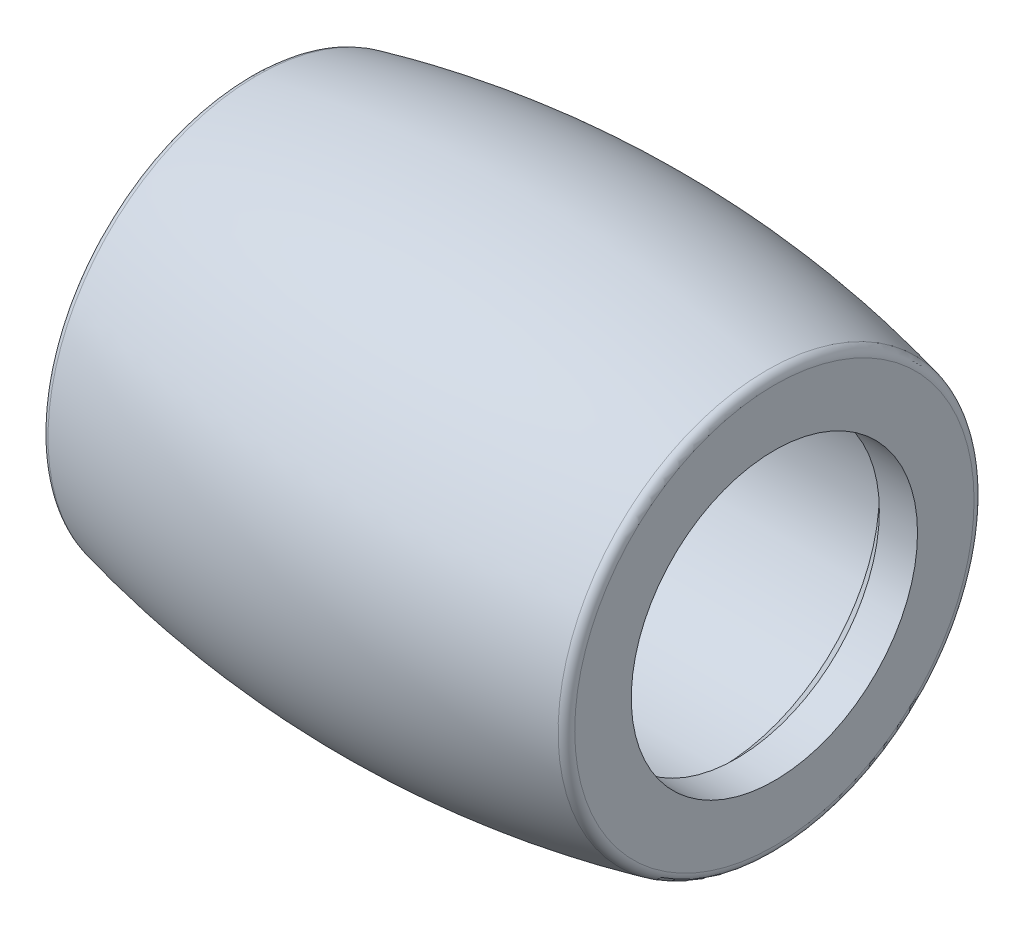
ISO-10303-21;
HEADER;
FILE_DESCRIPTION(('STEP AP214'),'2;1');
FILE_NAME('part.step','',(''),(''),'','','');
FILE_SCHEMA(('AUTOMOTIVE_DESIGN { 1 0 10303 214 1 1 1 1 }'));
ENDSEC;
DATA;
#1=APPLICATION_CONTEXT('core data for automotive mechanical design processes');
#2=APPLICATION_PROTOCOL_DEFINITION('international standard','automotive_design',2000,#1);
#3=PRODUCT_CONTEXT('',#1,'mechanical');
#4=PRODUCT('Part','Part','',(#3));
#5=PRODUCT_RELATED_PRODUCT_CATEGORY('part','',(#4));
#6=PRODUCT_DEFINITION_FORMATION('','',#4);
#7=PRODUCT_DEFINITION_CONTEXT('part definition',#1,'design');
#8=PRODUCT_DEFINITION('design','',#6,#7);
#9=PRODUCT_DEFINITION_SHAPE('','',#8);
#10=(LENGTH_UNIT() NAMED_UNIT(*) SI_UNIT(.MILLI.,.METRE.));
#11=(NAMED_UNIT(*) PLANE_ANGLE_UNIT() SI_UNIT($,.RADIAN.));
#12=(NAMED_UNIT(*) SI_UNIT($,.STERADIAN.) SOLID_ANGLE_UNIT());
#13=UNCERTAINTY_MEASURE_WITH_UNIT(LENGTH_MEASURE(1.E-05),#10,'distance_accuracy_value','');
#14=(GEOMETRIC_REPRESENTATION_CONTEXT(3) GLOBAL_UNCERTAINTY_ASSIGNED_CONTEXT((#13)) GLOBAL_UNIT_ASSIGNED_CONTEXT((#10,
#11,#12)) REPRESENTATION_CONTEXT('',''));
#15=CARTESIAN_POINT('',(0.,0.,0.));
#16=DIRECTION('',(0.,0.,1.));
#17=DIRECTION('',(1.,0.,0.));
#18=AXIS2_PLACEMENT_3D('',#15,#16,#17);
#19=CARTESIAN_POINT('',(-9.075,27.5,0.));
#20=DIRECTION('',(1.,0.,0.));
#21=DIRECTION('',(0.,0.,-1.));
#22=AXIS2_PLACEMENT_3D('',#19,#20,#21);
#23=CYLINDRICAL_SURFACE('',#22,5.);
#24=CARTESIAN_POINT('',(-6.55000000006112,27.5,0.));
#25=DIRECTION('',(1.,0.,0.));
#26=DIRECTION('',(0.,0.,-1.));
#27=AXIS2_PLACEMENT_3D('',#24,#25,#26);
#28=CIRCLE('',#27,4.99999999993861);
#29=CARTESIAN_POINT('',(-6.55000000006112,27.5,-4.99999999993861));
#30=VERTEX_POINT('',#29);
#31=EDGE_CURVE('E168',#30,#30,#28,.F.);
#32=ORIENTED_EDGE('',*,*,#31,.T.);
#33=EDGE_LOOP('',(#32));
#34=FACE_BOUND('',#33,.T.);
#35=CARTESIAN_POINT('',(6.55000000006112,27.5,0.));
#36=DIRECTION('',(-1.,0.,0.));
#37=DIRECTION('',(0.,0.,1.));
#38=AXIS2_PLACEMENT_3D('',#35,#36,#37);
#39=CIRCLE('',#38,4.99999999999545);
#40=CARTESIAN_POINT('',(6.55000000006112,27.5,4.99999999999545));
#41=VERTEX_POINT('',#40);
#42=EDGE_CURVE('E165',#41,#41,#39,.F.);
#43=ORIENTED_EDGE('',*,*,#42,.T.);
#44=EDGE_LOOP('',(#43));
#45=FACE_BOUND('',#44,.T.);
#46=ADVANCED_FACE('F16',(#34,#45),#23,.F.);
#47=CARTESIAN_POINT('',(-6.5500000001748,27.5,0.));
#48=DIRECTION('',(1.,0.,0.));
#49=DIRECTION('',(0.,0.,-1.));
#50=AXIS2_PLACEMENT_3D('',#47,#48,#49);
#51=CONICAL_SURFACE('',#50,4.99999999982492,0.785398163397448);
#52=ORIENTED_EDGE('',*,*,#31,.F.);
#53=EDGE_LOOP('',(#52));
#54=FACE_BOUND('',#53,.T.);
#55=CARTESIAN_POINT('',(-7.05,27.5,0.));
#56=DIRECTION('',(1.,0.,0.));
#57=DIRECTION('',(0.,0.,-1.));
#58=AXIS2_PLACEMENT_3D('',#55,#56,#57);
#59=CIRCLE('',#58,4.5);
#60=CARTESIAN_POINT('',(-7.05,27.5,-4.5));
#61=VERTEX_POINT('',#60);
#62=EDGE_CURVE('E162',#61,#61,#59,.F.);
#63=ORIENTED_EDGE('',*,*,#62,.T.);
#64=EDGE_LOOP('',(#63));
#65=FACE_BOUND('',#64,.T.);
#66=ADVANCED_FACE('F137',(#54,#65),#51,.F.);
#67=CARTESIAN_POINT('',(6.55000000006112,27.5,0.));
#68=DIRECTION('',(-1.,0.,0.));
#69=DIRECTION('',(0.,-1.,0.));
#70=AXIS2_PLACEMENT_3D('',#67,#68,#69);
#71=CONICAL_SURFACE('',#70,4.99999999999545,0.785398163454292);
#72=CARTESIAN_POINT('',(7.05,27.5,0.));
#73=DIRECTION('',(1.,0.,0.));
#74=DIRECTION('',(0.,0.,-1.));
#75=AXIS2_PLACEMENT_3D('',#72,#73,#74);
#76=CIRCLE('',#75,4.5);
#77=CARTESIAN_POINT('',(7.05,27.5,-4.5));
#78=VERTEX_POINT('',#77);
#79=EDGE_CURVE('E71',#78,#78,#76,.T.);
#80=ORIENTED_EDGE('',*,*,#79,.T.);
#81=EDGE_LOOP('',(#80));
#82=FACE_BOUND('',#81,.T.);
#83=ORIENTED_EDGE('',*,*,#42,.F.);
#84=EDGE_LOOP('',(#83));
#85=FACE_BOUND('',#84,.T.);
#86=ADVANCED_FACE('F133',(#82,#85),#71,.F.);
#87=CARTESIAN_POINT('',(-9.075,27.5,0.));
#88=DIRECTION('',(1.,0.,0.));
#89=DIRECTION('',(0.,0.,-1.));
#90=AXIS2_PLACEMENT_3D('',#87,#88,#89);
#91=CYLINDRICAL_SURFACE('',#90,4.5);
#92=ORIENTED_EDGE('',*,*,#62,.F.);
#93=EDGE_LOOP('',(#92));
#94=FACE_BOUND('',#93,.T.);
#95=CARTESIAN_POINT('',(-8.25,27.5,0.));
#96=DIRECTION('',(1.,0.,0.));
#97=DIRECTION('',(0.,0.,-1.));
#98=AXIS2_PLACEMENT_3D('',#95,#96,#97);
#99=CIRCLE('',#98,4.5);
#100=CARTESIAN_POINT('',(-8.25,27.5,-4.5));
#101=VERTEX_POINT('',#100);
#102=EDGE_CURVE('E64',#101,#101,#99,.F.);
#103=ORIENTED_EDGE('',*,*,#102,.T.);
#104=EDGE_LOOP('',(#103));
#105=FACE_BOUND('',#104,.T.);
#106=ADVANCED_FACE('F129',(#94,#105),#91,.F.);
#107=CARTESIAN_POINT('',(-9.075,27.5,0.));
#108=DIRECTION('',(1.,0.,0.));
#109=DIRECTION('',(0.,0.,-1.));
#110=AXIS2_PLACEMENT_3D('',#107,#108,#109);
#111=CYLINDRICAL_SURFACE('',#110,4.5);
#112=ORIENTED_EDGE('',*,*,#79,.F.);
#113=EDGE_LOOP('',(#112));
#114=FACE_BOUND('',#113,.T.);
#115=CARTESIAN_POINT('',(8.25,27.5,0.));
#116=DIRECTION('',(1.,0.,0.));
#117=DIRECTION('',(0.,0.,-1.));
#118=AXIS2_PLACEMENT_3D('',#115,#116,#117);
#119=CIRCLE('',#118,4.5);
#120=CARTESIAN_POINT('',(8.25,27.5,-4.5));
#121=VERTEX_POINT('',#120);
#122=EDGE_CURVE('E59',#121,#121,#119,.F.);
#123=ORIENTED_EDGE('',*,*,#122,.F.);
#124=EDGE_LOOP('',(#123));
#125=FACE_BOUND('',#124,.T.);
#126=ADVANCED_FACE('F125',(#114,#125),#111,.F.);
#127=CARTESIAN_POINT('',(-8.25,27.5,0.));
#128=DIRECTION('',(1.,0.,0.));
#129=DIRECTION('',(0.,0.,-1.));
#130=AXIS2_PLACEMENT_3D('',#127,#128,#129);
#131=PLANE('',#130);
#132=CARTESIAN_POINT('',(-8.24999999998339,27.5,0.));
#133=DIRECTION('',(1.,0.,0.));
#134=DIRECTION('',(0.,0.,-1.));
#135=AXIS2_PLACEMENT_3D('',#132,#133,#134);
#136=CIRCLE('',#135,6.27702305906739);
#137=CARTESIAN_POINT('',(-8.24999999999585,33.7768331617389,0.0491290998852763));
#138=VERTEX_POINT('',#137);
#139=CARTESIAN_POINT('',(-8.25,21.2231673117957,-0.0491290960355121));
#140=VERTEX_POINT('',#139);
#141=EDGE_CURVE('E72',#138,#140,#136,.T.);
#142=ORIENTED_EDGE('',*,*,#141,.F.);
#143=DIRECTION('',(0.,0.003913436133961,-0.999992342479494));
#144=VECTOR('',#143,1.);
#145=CARTESIAN_POINT('',(-8.25,33.7768339509583,0.049129106205928));
#146=LINE('',#145,#144);
#147=CARTESIAN_POINT('',(-8.25,33.7770262160479,0.));
#148=VERTEX_POINT('',#147);
#149=EDGE_CURVE('E62',#148,#138,#146,.F.);
#150=ORIENTED_EDGE('',*,*,#149,.F.);
#151=CARTESIAN_POINT('',(-8.25,21.2231660490486,-0.0491291059191057));
#152=CARTESIAN_POINT('',(-8.25,21.2519452129893,-3.72601330568912));
#153=CARTESIAN_POINT('',(-8.25,23.8722449062931,-6.30561311497492));
#154=CARTESIAN_POINT('',(-8.25,27.5491291060625,-6.27683395095026));
#155=CARTESIAN_POINT('',(-8.25,31.2260133058318,-6.2480547869256));
#156=CARTESIAN_POINT('',(-8.25,33.8056131150578,-3.62775509356284));
#157=CARTESIAN_POINT('',(-8.25,33.7768339509491,0.0491291062058564));
#158=(BOUNDED_CURVE() B_SPLINE_CURVE(3,(#151,#152,#153,#154,#155,#156,#157),.UNSPECIFIED.,.F.,
.F.) B_SPLINE_CURVE_WITH_KNOTS((4,3,4),(0.,0.5,1.),
.UNSPECIFIED.) CURVE() GEOMETRIC_REPRESENTATION_ITEM() RATIONAL_B_SPLINE_CURVE((1.,
0.804737854118981,0.804737854118981,1.,0.804737854118981,0.804737854118981,1.)) REPRESENTATION_ITEM(''));
#159=EDGE_CURVE('E58',#140,#148,#158,.T.);
#160=ORIENTED_EDGE('',*,*,#159,.F.);
#161=EDGE_LOOP('',(#142,#150,#160));
#162=FACE_BOUND('',#161,.T.);
#163=ORIENTED_EDGE('',*,*,#102,.F.);
#164=EDGE_LOOP('',(#163));
#165=FACE_BOUND('',#164,.T.);
#166=ADVANCED_FACE('F121',(#162,#165),#131,.F.);
#167=CARTESIAN_POINT('',(8.25,27.5,0.));
#168=DIRECTION('',(1.,0.,0.));
#169=DIRECTION('',(0.,0.,-1.));
#170=AXIS2_PLACEMENT_3D('',#167,#168,#169);
#171=PLANE('',#170);
#172=DIRECTION('',(0.,0.0027193663312331,-0.999996302516543));
#173=VECTOR('',#172,1.);
#174=CARTESIAN_POINT('',(8.25,21.2229737839488,0.));
#175=LINE('',#174,#173);
#176=CARTESIAN_POINT('',(8.25,21.2229737839488,-2.26550820204424E-13));
#177=VERTEX_POINT('',#176);
#178=CARTESIAN_POINT('',(8.25,21.2230630421132,-0.0332540212333076));
#179=VERTEX_POINT('',#178);
#180=EDGE_CURVE('E50',#177,#179,#175,.T.);
#181=ORIENTED_EDGE('',*,*,#180,.T.);
#182=CARTESIAN_POINT('',(8.25,27.5,0.));
#183=DIRECTION('',(1.,0.,0.));
#184=DIRECTION('',(0.,0.,-1.));
#185=AXIS2_PLACEMENT_3D('',#182,#183,#184);
#186=CIRCLE('',#185,6.2770262160512);
#187=EDGE_CURVE('E52',#177,#179,#186,.F.);
#188=ORIENTED_EDGE('',*,*,#187,.F.);
#189=EDGE_LOOP('',(#181,#188));
#190=FACE_BOUND('',#189,.T.);
#191=ORIENTED_EDGE('',*,*,#122,.T.);
#192=EDGE_LOOP('',(#191));
#193=FACE_BOUND('',#192,.T.);
#194=ADVANCED_FACE('F56',(#190,#193),#171,.T.);
#195=CARTESIAN_POINT('',(-8.01873198847112,20.9311545940471,-0.0514146947708205));
#196=CARTESIAN_POINT('',(-8.01873198847112,20.9612726249392,-3.89935524451549));
#197=CARTESIAN_POINT('',(-8.01873198847112,23.7034741451769,-6.5989634369316));
#198=CARTESIAN_POINT('',(-8.01873198847112,27.5514146949209,-6.56884540595168));
#199=CARTESIAN_POINT('',(-8.01873198847112,31.3993552446648,-6.53872737497177));
#200=CARTESIAN_POINT('',(-8.01873198847112,34.0989634370183,-3.79652585467239));
#201=CARTESIAN_POINT('',(-8.01873198847112,34.0688454059505,0.0514146950709067));
#202=CARTESIAN_POINT('',(-8.15993776943606,20.9643887682665,-0.0511545691600242));
#203=CARTESIAN_POINT('',(-8.15993776943606,20.9943544211037,-3.8796269903809));
#204=CARTESIAN_POINT('',(-8.15993776943606,23.7226821480891,-6.56557688465687));
#205=CARTESIAN_POINT('',(-8.15993776943606,27.5511545693093,-6.53561123173229));
#206=CARTESIAN_POINT('',(-8.15993776943606,31.3796269905295,-6.50564557880771));
#207=CARTESIAN_POINT('',(-8.15993776943606,34.0655768847432,-3.77731785176091));
#208=CARTESIAN_POINT('',(-8.15993776943606,34.0356112317311,0.0511545694585891));
#209=CARTESIAN_POINT('',(-8.25000000000193,21.0781061942674,-0.0502644969499736));
#210=CARTESIAN_POINT('',(-8.25000000000194,21.1075504548753,-3.8121227922965));
#211=CARTESIAN_POINT('',(-8.25000000000194,23.7884062017508,-6.45133806642537));
#212=CARTESIAN_POINT('',(-8.25000000000193,27.5502644970967,-6.42189380573147));
#213=CARTESIAN_POINT('',(-8.25000000000194,31.3121227924425,-6.39244954503758));
#214=CARTESIAN_POINT('',(-8.25000000000194,33.9513380665102,-3.71159379810184));
#215=CARTESIAN_POINT('',(-8.25000000000193,33.9218938057303,0.0502644972433484));
#216=CARTESIAN_POINT('',(-8.25,21.2231660490395,-0.0491291059191772));
#217=CARTESIAN_POINT('',(-8.25,21.2519452129802,-3.72601330569454));
#218=CARTESIAN_POINT('',(-8.25,23.8722449062878,-6.30561311498409));
#219=CARTESIAN_POINT('',(-8.25,27.5491291060626,-6.27683395095939));
#220=CARTESIAN_POINT('',(-8.25,31.2260133058373,-6.2480547869347));
#221=CARTESIAN_POINT('',(-8.25,33.805613115067,-3.62775509356812));
#222=CARTESIAN_POINT('',(-8.25,33.7768339509583,0.0491291062059279));
#223=CARTESIAN_POINT('',(-8.25,21.2233660429135,-0.0491275405567196));
#224=CARTESIAN_POINT('',(-8.25,21.2521442898861,-3.72589458663308));
#225=CARTESIAN_POINT('',(-8.25,23.8723604946244,-6.30541220414199));
#226=CARTESIAN_POINT('',(-8.25,27.5491275407001,-6.27663395708539));
#227=CARTESIAN_POINT('',(-8.25,31.2258945867758,-6.24785571002879));
#228=CARTESIAN_POINT('',(-8.25,33.8054122042249,-3.62763950523158));
#229=CARTESIAN_POINT('',(-8.25,33.7766339570843,0.0491275408434612));
#230=CARTESIAN_POINT('',(-8.24999999999999,21.2235660367875,-0.049125975194262));
#231=CARTESIAN_POINT('',(-8.24999999999999,21.252343366792,-3.72577586757162));
#232=CARTESIAN_POINT('',(-8.24999999999999,23.8724760829609,-6.30521129329988));
#233=CARTESIAN_POINT('',(-8.24999999999999,27.5491259753376,-6.27643396321138));
#234=CARTESIAN_POINT('',(-8.24999999999999,31.2257758677143,-6.24765663312288));
#235=CARTESIAN_POINT('',(-8.24999999999999,33.8052112933827,-3.62752391689505));
#236=CARTESIAN_POINT('',(-8.24999999999999,33.7764339632103,0.0491259754809945));
#237=CARTESIAN_POINT('',(-8.24999999999999,21.2237660306615,-0.0491244098318045));
#238=CARTESIAN_POINT('',(-8.24999999999999,21.2525424436979,-3.72565714851015));
#239=CARTESIAN_POINT('',(-8.24999999999999,23.8725916712975,-6.30501038245777));
#240=CARTESIAN_POINT('',(-8.24999999999999,27.5491244099752,-6.27623396933737));
#241=CARTESIAN_POINT('',(-8.24999999999999,31.2256571486529,-6.24745755621698));
#242=CARTESIAN_POINT('',(-8.24999999999999,33.8050103825406,-3.62740832855851));
#243=CARTESIAN_POINT('',(-8.24999999999999,33.7762339693362,0.0491244101185278));
#244=(BOUNDED_SURFACE() B_SPLINE_SURFACE(3,3,((#195,#196,#197,#198,#199,#200,#201),(#202,#203,
#204,#205,#206,#207,#208),(#209,#210,#211,#212,#213,#214,#215),(#216,#217,#218,#219,#220,#221,
#222),(#223,#224,#225,#226,#227,#228,#229),(#230,#231,#232,#233,#234,#235,#236),(#237,#238,#239,
#240,#241,#242,#243)),.UNSPECIFIED.,.F.,.F.,.F.) B_SPLINE_SURFACE_WITH_KNOTS((4,3,4),(4,3,4),
(0.,1.,1.00161071180641),(0.,0.5,1.),
.UNSPECIFIED.) GEOMETRIC_REPRESENTATION_ITEM() RATIONAL_B_SPLINE_SURFACE(((1.,0.804737854118981,
0.804737854118981,1.,0.804737854118981,0.804737854118981,1.),(0.855956339210433,
0.688820467635743,0.688820467635743,0.855956339210433,0.688820467635743,0.688820467635743,
0.855956339210433),(0.855956339210433,0.688820467635743,0.688820467635743,0.855956339210433,
0.688820467635743,0.688820467635743,0.855956339210433),(1.,0.804737854118981,0.804737854118981,
1.,0.804737854118981,0.804737854118981,1.),(1.,0.804737854118981,0.804737854118981,1.,
0.804737854118981,0.804737854118981,1.),(1.,0.804737854118981,0.804737854118981,1.,
0.804737854118981,0.804737854118981,1.),(1.,0.804737854118981,0.804737854118981,1.,
0.804737854118981,0.804737854118981,1.))) REPRESENTATION_ITEM('') SURFACE());
#245=CARTESIAN_POINT('',(-7.95000000000001,33.7768339509645,0.0491291059191954));
#246=DIRECTION('',(0.,-0.00782681228788601,0.999969370035608));
#247=DIRECTION('',(0.,-0.999969370035608,-0.00782681228788602));
#248=AXIS2_PLACEMENT_3D('',#245,#246,#247);
#249=CIRCLE('',#248,0.299999999999995);
#250=CARTESIAN_POINT('',(-8.01873198847103,34.0688454059515,0.0514146947707961));
#251=VERTEX_POINT('',#250);
#252=EDGE_CURVE('E73',#251,#138,#249,.T.);
#253=CARTESIAN_POINT('',(-8.01873198847017,27.5,4.40252761264629E-12));
#254=DIRECTION('',(1.,0.,0.));
#255=DIRECTION('',(0.,1.,0.));
#256=AXIS2_PLACEMENT_3D('',#253,#254,#255);
#257=CIRCLE('',#256,6.56904661561282);
#258=CARTESIAN_POINT('',(-8.01873198847088,20.9311545940499,-0.0514146949958797));
#259=VERTEX_POINT('',#258);
#260=EDGE_CURVE('E34',#259,#251,#257,.T.);
#261=CARTESIAN_POINT('',(-7.95,21.2231660490377,-0.0491291062059583));
#262=DIRECTION('',(0.,-0.00782681233357451,0.99996937003525));
#263=DIRECTION('',(0.,-0.99996937003525,-0.00782681233357451));
#264=AXIS2_PLACEMENT_3D('',#261,#262,#263);
#265=CIRCLE('',#264,0.299999999999999);
#266=EDGE_CURVE('E54',#140,#259,#265,.T.);
#267=ORIENTED_EDGE('',*,*,#159,.T.);
#268=ORIENTED_EDGE('',*,*,#149,.T.);
#269=ORIENTED_EDGE('',*,*,#252,.F.);
#270=ORIENTED_EDGE('',*,*,#260,.F.);
#271=ORIENTED_EDGE('',*,*,#266,.F.);
#272=EDGE_LOOP('',(#267,#268,#269,#270,#271));
#273=FACE_BOUND('',#272,.T.);
#274=ADVANCED_FACE('F100',(#273),#244,.T.);
#275=CARTESIAN_POINT('',(-7.95000000000001,27.5,0.));
#276=DIRECTION('',(1.,0.,0.));
#277=DIRECTION('',(0.,0.,-1.));
#278=AXIS2_PLACEMENT_3D('',#275,#276,#277);
#279=TOROIDAL_SURFACE('',#278,6.277026216054,0.299999999999995);
#280=ORIENTED_EDGE('',*,*,#266,.T.);
#281=CARTESIAN_POINT('',(-8.01873198847063,27.5,4.40252761264629E-12));
#282=DIRECTION('',(1.,0.,0.));
#283=DIRECTION('',(0.,1.,0.));
#284=AXIS2_PLACEMENT_3D('',#281,#282,#283);
#285=CIRCLE('',#284,6.56904661561272);
#286=EDGE_CURVE('E26',#251,#259,#285,.T.);
#287=ORIENTED_EDGE('',*,*,#286,.F.);
#288=ORIENTED_EDGE('',*,*,#252,.T.);
#289=ORIENTED_EDGE('',*,*,#141,.T.);
#290=EDGE_LOOP('',(#280,#287,#288,#289));
#291=FACE_BOUND('',#290,.T.);
#292=ADVANCED_FACE('F112',(#291),#279,.T.);
#293=CARTESIAN_POINT('',(7.95000000000001,27.5,0.));
#294=DIRECTION('',(1.,0.,0.));
#295=DIRECTION('',(0.,0.,-1.));
#296=AXIS2_PLACEMENT_3D('',#293,#294,#295);
#297=TOROIDAL_SURFACE('',#296,6.277026216054,0.299999999999998);
#298=CARTESIAN_POINT('',(8.01873198847067,27.5,4.39598985750808E-12));
#299=DIRECTION('',(1.,0.,0.));
#300=DIRECTION('',(0.,1.,0.));
#301=AXIS2_PLACEMENT_3D('',#298,#299,#300);
#302=CIRCLE('',#301,6.5690466156127);
#303=CARTESIAN_POINT('',(8.01873198847068,34.0690466156127,4.39598985750808E-12));
#304=VERTEX_POINT('',#303);
#305=EDGE_CURVE('E11',#304,#304,#302,.F.);
#306=ORIENTED_EDGE('',*,*,#305,.F.);
#307=EDGE_LOOP('',(#306));
#308=FACE_BOUND('',#307,.T.);
#309=ORIENTED_EDGE('',*,*,#187,.T.);
#310=ORIENTED_EDGE('',*,*,#180,.F.);
#311=EDGE_LOOP('',(#309,#310));
#312=FACE_BOUND('',#311,.T.);
#313=ADVANCED_FACE('F18',(#308,#312),#297,.T.);
#314=CARTESIAN_POINT('',(0.,5.8113236445223E-11,4.39925873507718E-12));
#315=DIRECTION('',(0.,0.,1.));
#316=DIRECTION('',(0.,1.,0.));
#317=AXIS2_PLACEMENT_3D('',#314,#315,#316);
#318=CIRCLE('',#317,34.9999999999393);
#319=TRIMMED_CURVE('',#318,(PARAMETER_VALUE(-0.666946344504147)),
(PARAMETER_VALUE(0.666946344504147)),.T.,.PARAMETER.);
#320=CARTESIAN_POINT('',(0.,27.5,4.39925873507718E-12));
#321=DIRECTION('',(1.,0.,0.));
#322=AXIS1_PLACEMENT('',#320,#321);
#323=SURFACE_OF_REVOLUTION('',#319,#322);
#324=ORIENTED_EDGE('',*,*,#305,.T.);
#325=EDGE_LOOP('',(#324));
#326=FACE_BOUND('',#325,.T.);
#327=ORIENTED_EDGE('',*,*,#286,.T.);
#328=ORIENTED_EDGE('',*,*,#260,.T.);
#329=EDGE_LOOP('',(#327,#328));
#330=FACE_BOUND('',#329,.T.);
#331=ADVANCED_FACE('F113',(#326,#330),#323,.F.);
#332=CLOSED_SHELL('',(#46,#66,#86,#106,#126,#166,#194,#274,#292,#313,#331));
#333=MANIFOLD_SOLID_BREP('B1',#332);
#334=ADVANCED_BREP_SHAPE_REPRESENTATION('',(#18,#333),#14);
#335=SHAPE_DEFINITION_REPRESENTATION(#9,#334);
ENDSEC;
END-ISO-10303-21;
